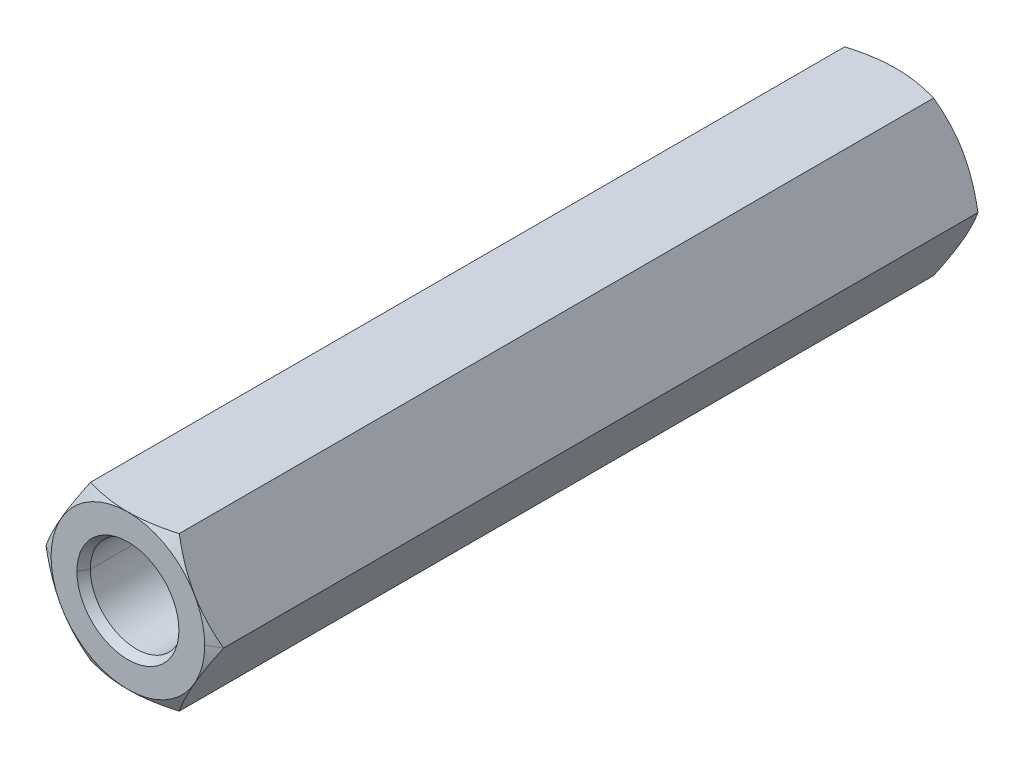
ISO-10303-21;
HEADER;
FILE_DESCRIPTION(('STEP AP214'),'2;1');
FILE_NAME('part.step','',(''),(''),'','','');
FILE_SCHEMA(('AUTOMOTIVE_DESIGN { 1 0 10303 214 1 1 1 1 }'));
ENDSEC;
DATA;
#1=APPLICATION_CONTEXT('core data for automotive mechanical design processes');
#2=APPLICATION_PROTOCOL_DEFINITION('international standard','automotive_design',2000,#1);
#3=PRODUCT_CONTEXT('',#1,'mechanical');
#4=PRODUCT('Part','Part','',(#3));
#5=PRODUCT_RELATED_PRODUCT_CATEGORY('part','',(#4));
#6=PRODUCT_DEFINITION_FORMATION('','',#4);
#7=PRODUCT_DEFINITION_CONTEXT('part definition',#1,'design');
#8=PRODUCT_DEFINITION('design','',#6,#7);
#9=PRODUCT_DEFINITION_SHAPE('','',#8);
#10=(LENGTH_UNIT() NAMED_UNIT(*) SI_UNIT(.MILLI.,.METRE.));
#11=(NAMED_UNIT(*) PLANE_ANGLE_UNIT() SI_UNIT($,.RADIAN.));
#12=(NAMED_UNIT(*) SI_UNIT($,.STERADIAN.) SOLID_ANGLE_UNIT());
#13=UNCERTAINTY_MEASURE_WITH_UNIT(LENGTH_MEASURE(1.E-05),#10,'distance_accuracy_value','');
#14=(GEOMETRIC_REPRESENTATION_CONTEXT(3) GLOBAL_UNCERTAINTY_ASSIGNED_CONTEXT((#13)) GLOBAL_UNIT_ASSIGNED_CONTEXT((#10,
#11,#12)) REPRESENTATION_CONTEXT('',''));
#15=CARTESIAN_POINT('',(0.,0.,0.));
#16=DIRECTION('',(0.,0.,1.));
#17=DIRECTION('',(1.,0.,0.));
#18=AXIS2_PLACEMENT_3D('',#15,#16,#17);
#19=CARTESIAN_POINT('',(220.318744279938,128.56204329235,90.4476083123826));
#20=DIRECTION('',(0.,0.,-1.));
#21=DIRECTION('',(1.,0.,0.));
#22=AXIS2_PLACEMENT_3D('',#19,#20,#21);
#23=CONICAL_SURFACE('',#22,1.7320508075705,1.047197551197);
#24=DIRECTION('',(0.86602540378464,0.,-0.499999999999652));
#25=VECTOR('',#24,1.);
#26=CARTESIAN_POINT('',(222.050795087508,128.56204329235,90.4476083123826));
#27=LINE('',#26,#25);
#28=CARTESIAN_POINT('',(220.318744279938,128.56204329235,91.4476083123826));
#29=VERTEX_POINT('',#28);
#30=CARTESIAN_POINT('',(221.818744279938,128.56204329235,90.5815829085986));
#31=VERTEX_POINT('',#30);
#32=EDGE_CURVE('E67',#29,#31,#27,.T.);
#33=ORIENTED_EDGE('',*,*,#32,.F.);
#34=DIRECTION('',(-0.86602540378464,0.,-0.499999999999652));
#35=VECTOR('',#34,1.);
#36=CARTESIAN_POINT('',(218.586693472367,128.56204329235,90.4476083123826));
#37=LINE('',#36,#35);
#38=CARTESIAN_POINT('',(218.818744279938,128.56204329235,90.5815829085986));
#39=VERTEX_POINT('',#38);
#40=EDGE_CURVE('E11',#29,#39,#37,.T.);
#41=ORIENTED_EDGE('',*,*,#40,.T.);
#42=CARTESIAN_POINT('',(220.318744279938,128.56204329235,90.5815829085986));
#43=DIRECTION('',(0.,0.,1.));
#44=DIRECTION('',(1.,0.,0.));
#45=AXIS2_PLACEMENT_3D('',#42,#43,#44);
#46=CIRCLE('',#45,1.5);
#47=EDGE_CURVE('E55',#31,#39,#46,.T.);
#48=ORIENTED_EDGE('',*,*,#47,.F.);
#49=EDGE_LOOP('',(#33,#41,#48));
#50=FACE_BOUND('',#49,.T.);
#51=ADVANCED_FACE('F44',(#50),#23,.F.);
#52=CARTESIAN_POINT('',(220.318744279938,128.56204329235,90.5815829085986));
#53=DIRECTION('',(0.,0.,-1.));
#54=DIRECTION('',(1.,0.,0.));
#55=AXIS2_PLACEMENT_3D('',#52,#53,#54);
#56=CYLINDRICAL_SURFACE('',#55,1.5);
#57=ORIENTED_EDGE('',*,*,#47,.T.);
#58=DIRECTION('',(0.,0.,-1.));
#59=VECTOR('',#58,1.);
#60=CARTESIAN_POINT('',(218.818744279938,128.56204329235,90.5815829085986));
#61=LINE('',#60,#59);
#62=CARTESIAN_POINT('',(218.818744279938,128.56204329235,80.8587110378087));
#63=VERTEX_POINT('',#62);
#64=EDGE_CURVE('E223',#39,#63,#61,.T.);
#65=ORIENTED_EDGE('',*,*,#64,.T.);
#66=CARTESIAN_POINT('',(220.318744279938,128.56204329235,80.8587110378087));
#67=DIRECTION('',(0.,0.,1.));
#68=DIRECTION('',(1.,0.,0.));
#69=AXIS2_PLACEMENT_3D('',#66,#67,#68);
#70=CIRCLE('',#69,1.5);
#71=CARTESIAN_POINT('',(221.818744279938,128.56204329235,80.8587110378087));
#72=VERTEX_POINT('',#71);
#73=EDGE_CURVE('E258',#72,#63,#70,.T.);
#74=ORIENTED_EDGE('',*,*,#73,.F.);
#75=DIRECTION('',(0.,0.,-1.));
#76=VECTOR('',#75,1.);
#77=CARTESIAN_POINT('',(221.818744279938,128.56204329235,90.5815829085986));
#78=LINE('',#77,#76);
#79=EDGE_CURVE('E226',#31,#72,#78,.T.);
#80=ORIENTED_EDGE('',*,*,#79,.F.);
#81=EDGE_LOOP('',(#57,#65,#74,#80));
#82=FACE_BOUND('',#81,.T.);
#83=ADVANCED_FACE('F381',(#82),#56,.F.);
#84=CARTESIAN_POINT('',(220.318744279938,128.56204329235,80.8587110378087));
#85=DIRECTION('',(0.,0.,-1.));
#86=DIRECTION('',(1.,0.,0.));
#87=AXIS2_PLACEMENT_3D('',#84,#85,#86);
#88=CONICAL_SURFACE('',#87,1.5,0.5235987756);
#89=ORIENTED_EDGE('',*,*,#73,.T.);
#90=DIRECTION('',(-0.500000000001473,0.,-0.866025403783588));
#91=VECTOR('',#90,1.);
#92=CARTESIAN_POINT('',(218.818744279938,128.56204329235,80.8587110378087));
#93=LINE('',#92,#91);
#94=CARTESIAN_POINT('',(218.658744279937,128.56204329235,80.5815829085986));
#95=VERTEX_POINT('',#94);
#96=EDGE_CURVE('E254',#63,#95,#93,.T.);
#97=ORIENTED_EDGE('',*,*,#96,.T.);
#98=CARTESIAN_POINT('',(220.318744279938,128.56204329235,80.5815829085986));
#99=DIRECTION('',(0.,0.,1.));
#100=DIRECTION('',(1.,0.,0.));
#101=AXIS2_PLACEMENT_3D('',#98,#99,#100);
#102=CIRCLE('',#101,1.66);
#103=CARTESIAN_POINT('',(221.978744279938,128.56204329235,80.5815829085986));
#104=VERTEX_POINT('',#103);
#105=EDGE_CURVE('E317',#104,#95,#102,.T.);
#106=ORIENTED_EDGE('',*,*,#105,.F.);
#107=DIRECTION('',(0.500000000001473,0.,-0.866025403783588));
#108=VECTOR('',#107,1.);
#109=CARTESIAN_POINT('',(221.818744279938,128.56204329235,80.8587110378087));
#110=LINE('',#109,#108);
#111=EDGE_CURVE('E253',#72,#104,#110,.T.);
#112=ORIENTED_EDGE('',*,*,#111,.F.);
#113=EDGE_LOOP('',(#89,#97,#106,#112));
#114=FACE_BOUND('',#113,.T.);
#115=ADVANCED_FACE('F372',(#114),#88,.F.);
#116=CARTESIAN_POINT('',(220.318744279938,128.56204329235,80.5815829085986));
#117=DIRECTION('',(0.,0.,1.));
#118=DIRECTION('',(1.,0.,0.));
#119=AXIS2_PLACEMENT_3D('',#116,#117,#118);
#120=CONICAL_SURFACE('',#119,2.5,1.047197551197);
#121=CARTESIAN_POINT('',(220.318744279938,128.56204329235,80.5815829085986));
#122=DIRECTION('',(0.,0.,1.));
#123=DIRECTION('',(1.,0.,0.));
#124=AXIS2_PLACEMENT_3D('',#121,#122,#123);
#125=CIRCLE('',#124,2.5);
#126=CARTESIAN_POINT('',(222.818744279938,128.56204329235,80.5815829085986));
#127=VERTEX_POINT('',#126);
#128=CARTESIAN_POINT('',(217.818744279938,128.56204329235,80.5815829085986));
#129=VERTEX_POINT('',#128);
#130=EDGE_CURVE('E259',#127,#129,#125,.T.);
#131=ORIENTED_EDGE('',*,*,#130,.T.);
#132=DIRECTION('',(-0.86602540378464,0.,0.499999999999652));
#133=VECTOR('',#132,1.);
#134=CARTESIAN_POINT('',(217.818744279938,128.56204329235,80.5815829085986));
#135=LINE('',#134,#133);
#136=CARTESIAN_POINT('',(217.428744279937,128.56204329235,80.8067495135827));
#137=VERTEX_POINT('',#136);
#138=EDGE_CURVE('E198',#129,#137,#135,.T.);
#139=ORIENTED_EDGE('',*,*,#138,.T.);
#140=CARTESIAN_POINT('',(218.873744279938,131.064856709287,80.8067495135827));
#141=CARTESIAN_POINT('',(218.151244279938,129.813450000819,80.3896139440931));
#142=CARTESIAN_POINT('',(217.428744279937,128.56204329235,80.8067495135827));
#143=(BOUNDED_CURVE() B_SPLINE_CURVE(2,(#140,#141,#142),.UNSPECIFIED.,.F.,
.F.) B_SPLINE_CURVE_WITH_KNOTS((3,3),(0.,1.),
.UNSPECIFIED.) CURVE() GEOMETRIC_REPRESENTATION_ITEM() RATIONAL_B_SPLINE_CURVE((1.,
1.15470053837935,1.)) REPRESENTATION_ITEM(''));
#144=CARTESIAN_POINT('',(218.873744279938,131.064856709287,80.8067495135827));
#145=VERTEX_POINT('',#144);
#146=EDGE_CURVE('E295',#145,#137,#143,.T.);
#147=ORIENTED_EDGE('',*,*,#146,.F.);
#148=CARTESIAN_POINT('',(221.763744279937,131.064856709287,80.8067495135827));
#149=CARTESIAN_POINT('',(220.318744279938,131.064856709288,80.3896139440931));
#150=CARTESIAN_POINT('',(218.873744279938,131.064856709287,80.8067495135827));
#151=(BOUNDED_CURVE() B_SPLINE_CURVE(2,(#148,#149,#150),.UNSPECIFIED.,.F.,
.F.) B_SPLINE_CURVE_WITH_KNOTS((3,3),(0.,1.),
.UNSPECIFIED.) CURVE() GEOMETRIC_REPRESENTATION_ITEM() RATIONAL_B_SPLINE_CURVE((1.,
1.15470053837926,1.)) REPRESENTATION_ITEM(''));
#152=CARTESIAN_POINT('',(221.763744279937,131.064856709287,80.8067495135827));
#153=VERTEX_POINT('',#152);
#154=EDGE_CURVE('E313',#153,#145,#151,.T.);
#155=ORIENTED_EDGE('',*,*,#154,.F.);
#156=CARTESIAN_POINT('',(223.208744279937,128.56204329235,80.8067495135827));
#157=CARTESIAN_POINT('',(222.486244279938,129.813450000819,80.389613944093));
#158=CARTESIAN_POINT('',(221.763744279937,131.064856709287,80.8067495135827));
#159=(BOUNDED_CURVE() B_SPLINE_CURVE(2,(#156,#157,#158),.UNSPECIFIED.,.F.,
.F.) B_SPLINE_CURVE_WITH_KNOTS((3,3),(0.,1.),
.UNSPECIFIED.) CURVE() GEOMETRIC_REPRESENTATION_ITEM() RATIONAL_B_SPLINE_CURVE((1.,
1.15470053837946,1.)) REPRESENTATION_ITEM(''));
#160=CARTESIAN_POINT('',(223.208744279937,128.56204329235,80.8067495135827));
#161=VERTEX_POINT('',#160);
#162=EDGE_CURVE('E238',#161,#153,#159,.T.);
#163=ORIENTED_EDGE('',*,*,#162,.F.);
#164=DIRECTION('',(0.86602540378464,0.,0.499999999999652));
#165=VECTOR('',#164,1.);
#166=CARTESIAN_POINT('',(222.818744279938,128.56204329235,80.5815829085986));
#167=LINE('',#166,#165);
#168=EDGE_CURVE('E314',#127,#161,#167,.T.);
#169=ORIENTED_EDGE('',*,*,#168,.F.);
#170=EDGE_LOOP('',(#131,#139,#147,#155,#163,#169));
#171=FACE_BOUND('',#170,.T.);
#172=ADVANCED_FACE('F433',(#171),#120,.T.);
#173=CARTESIAN_POINT('',(220.318744279938,128.56204329235,105.356416303615));
#174=DIRECTION('',(0.,0.,-1.));
#175=DIRECTION('',(1.,0.,0.));
#176=AXIS2_PLACEMENT_3D('',#173,#174,#175);
#177=CONICAL_SURFACE('',#176,2.89,1.047197551197);
#178=CARTESIAN_POINT('',(220.318744279938,128.56204329235,105.581582908599));
#179=DIRECTION('',(0.,0.,1.));
#180=DIRECTION('',(1.,0.,0.));
#181=AXIS2_PLACEMENT_3D('',#178,#179,#180);
#182=CIRCLE('',#181,2.5);
#183=CARTESIAN_POINT('',(217.818744279938,128.56204329235,105.581582908599));
#184=VERTEX_POINT('',#183);
#185=CARTESIAN_POINT('',(222.818744279938,128.56204329235,105.581582908599));
#186=VERTEX_POINT('',#185);
#187=EDGE_CURVE('E178',#184,#186,#182,.T.);
#188=ORIENTED_EDGE('',*,*,#187,.F.);
#189=DIRECTION('',(-0.86602540378464,0.,-0.499999999999652));
#190=VECTOR('',#189,1.);
#191=CARTESIAN_POINT('',(217.428744279937,128.56204329235,105.356416303615));
#192=LINE('',#191,#190);
#193=CARTESIAN_POINT('',(217.428744279937,128.562043292351,105.356416303615));
#194=VERTEX_POINT('',#193);
#195=EDGE_CURVE('E182',#184,#194,#192,.T.);
#196=ORIENTED_EDGE('',*,*,#195,.T.);
#197=CARTESIAN_POINT('',(218.873744279938,126.059229875413,105.356416303615));
#198=CARTESIAN_POINT('',(218.151244279937,127.310636583882,105.773551873104));
#199=CARTESIAN_POINT('',(217.428744279937,128.562043292351,105.356416303615));
#200=(BOUNDED_CURVE() B_SPLINE_CURVE(2,(#197,#198,#199),.UNSPECIFIED.,.F.,
.F.) B_SPLINE_CURVE_WITH_KNOTS((3,3),(0.,1.),
.UNSPECIFIED.) CURVE() GEOMETRIC_REPRESENTATION_ITEM() RATIONAL_B_SPLINE_CURVE((1.,
1.15470053837936,1.)) REPRESENTATION_ITEM(''));
#201=CARTESIAN_POINT('',(218.873744279938,126.059229875413,105.356416303615));
#202=VERTEX_POINT('',#201);
#203=EDGE_CURVE('E324',#202,#194,#200,.T.);
#204=ORIENTED_EDGE('',*,*,#203,.F.);
#205=CARTESIAN_POINT('',(221.763744279937,126.059229875413,105.356416303615));
#206=CARTESIAN_POINT('',(220.318744279937,126.059229875413,105.773551873104));
#207=CARTESIAN_POINT('',(218.873744279938,126.059229875413,105.356416303615));
#208=(BOUNDED_CURVE() B_SPLINE_CURVE(2,(#205,#206,#207),.UNSPECIFIED.,.F.,
.F.) B_SPLINE_CURVE_WITH_KNOTS((3,3),(0.,1.),
.UNSPECIFIED.) CURVE() GEOMETRIC_REPRESENTATION_ITEM() RATIONAL_B_SPLINE_CURVE((1.,
1.15470053837925,1.)) REPRESENTATION_ITEM(''));
#209=CARTESIAN_POINT('',(221.763744279937,126.059229875413,105.356416303615));
#210=VERTEX_POINT('',#209);
#211=EDGE_CURVE('E305',#210,#202,#208,.T.);
#212=ORIENTED_EDGE('',*,*,#211,.F.);
#213=CARTESIAN_POINT('',(223.208744279937,128.56204329235,105.356416303615));
#214=CARTESIAN_POINT('',(222.486244279938,127.310636583882,105.773551873104));
#215=CARTESIAN_POINT('',(221.763744279937,126.059229875413,105.356416303615));
#216=(BOUNDED_CURVE() B_SPLINE_CURVE(2,(#213,#214,#215),.UNSPECIFIED.,.F.,
.F.) B_SPLINE_CURVE_WITH_KNOTS((3,3),(0.,1.),
.UNSPECIFIED.) CURVE() GEOMETRIC_REPRESENTATION_ITEM() RATIONAL_B_SPLINE_CURVE((1.,
1.15470053837944,1.)) REPRESENTATION_ITEM(''));
#217=CARTESIAN_POINT('',(223.208744279937,128.56204329235,105.356416303615));
#218=VERTEX_POINT('',#217);
#219=EDGE_CURVE('E272',#218,#210,#216,.T.);
#220=ORIENTED_EDGE('',*,*,#219,.F.);
#221=DIRECTION('',(0.86602540378464,0.,-0.499999999999652));
#222=VECTOR('',#221,1.);
#223=CARTESIAN_POINT('',(223.208744279937,128.56204329235,105.356416303615));
#224=LINE('',#223,#222);
#225=EDGE_CURVE('E186',#186,#218,#224,.T.);
#226=ORIENTED_EDGE('',*,*,#225,.F.);
#227=EDGE_LOOP('',(#188,#196,#204,#212,#220,#226));
#228=FACE_BOUND('',#227,.T.);
#229=ADVANCED_FACE('F180',(#228),#177,.T.);
#230=CARTESIAN_POINT('',(220.318744279938,128.56204329235,105.581582908599));
#231=DIRECTION('',(0.,0.,1.));
#232=DIRECTION('',(1.,0.,0.));
#233=AXIS2_PLACEMENT_3D('',#230,#231,#232);
#234=CONICAL_SURFACE('',#233,1.65999999999899,0.523598775598);
#235=CARTESIAN_POINT('',(220.318744279938,128.56204329235,105.304454779389));
#236=DIRECTION('',(0.,0.,1.));
#237=DIRECTION('',(1.,0.,0.));
#238=AXIS2_PLACEMENT_3D('',#235,#236,#237);
#239=CIRCLE('',#238,1.5);
#240=CARTESIAN_POINT('',(218.818744279938,128.56204329235,105.304454779389));
#241=VERTEX_POINT('',#240);
#242=CARTESIAN_POINT('',(221.818744279938,128.56204329235,105.304454779389));
#243=VERTEX_POINT('',#242);
#244=EDGE_CURVE('E260',#241,#243,#239,.T.);
#245=ORIENTED_EDGE('',*,*,#244,.F.);
#246=DIRECTION('',(-0.499999999999741,0.,0.866025403784588));
#247=VECTOR('',#246,1.);
#248=CARTESIAN_POINT('',(218.658744279938,128.56204329235,105.581582908599));
#249=LINE('',#248,#247);
#250=CARTESIAN_POINT('',(218.658744279938,128.56204329235,105.581582908599));
#251=VERTEX_POINT('',#250);
#252=EDGE_CURVE('E199',#241,#251,#249,.T.);
#253=ORIENTED_EDGE('',*,*,#252,.T.);
#254=CARTESIAN_POINT('',(220.318744279938,128.56204329235,105.581582908599));
#255=DIRECTION('',(0.,0.,1.));
#256=DIRECTION('',(1.,0.,0.));
#257=AXIS2_PLACEMENT_3D('',#254,#255,#256);
#258=CIRCLE('',#257,1.65999999999899);
#259=CARTESIAN_POINT('',(221.978744279937,128.56204329235,105.581582908599));
#260=VERTEX_POINT('',#259);
#261=EDGE_CURVE('E230',#251,#260,#258,.T.);
#262=ORIENTED_EDGE('',*,*,#261,.T.);
#263=DIRECTION('',(0.499999999999741,0.,0.866025403784588));
#264=VECTOR('',#263,1.);
#265=CARTESIAN_POINT('',(221.978744279937,128.56204329235,105.581582908599));
#266=LINE('',#265,#264);
#267=EDGE_CURVE('E210',#243,#260,#266,.T.);
#268=ORIENTED_EDGE('',*,*,#267,.F.);
#269=EDGE_LOOP('',(#245,#253,#262,#268));
#270=FACE_BOUND('',#269,.T.);
#271=ADVANCED_FACE('F486',(#270),#234,.F.);
#272=CARTESIAN_POINT('',(220.318744279938,128.56204329235,105.304454779389));
#273=DIRECTION('',(0.,0.,-1.));
#274=DIRECTION('',(1.,0.,0.));
#275=AXIS2_PLACEMENT_3D('',#272,#273,#274);
#276=CYLINDRICAL_SURFACE('',#275,1.5);
#277=CARTESIAN_POINT('',(220.318744279938,128.56204329235,105.304454779389));
#278=DIRECTION('',(0.,0.,1.));
#279=DIRECTION('',(1.,0.,0.));
#280=AXIS2_PLACEMENT_3D('',#277,#278,#279);
#281=CIRCLE('',#280,1.5);
#282=EDGE_CURVE('E246',#243,#241,#281,.T.);
#283=ORIENTED_EDGE('',*,*,#282,.T.);
#284=DIRECTION('',(0.,0.,-1.));
#285=VECTOR('',#284,1.);
#286=CARTESIAN_POINT('',(218.818744279938,128.56204329235,105.304454779389));
#287=LINE('',#286,#285);
#288=CARTESIAN_POINT('',(218.818744279938,128.56204329235,95.5815829085986));
#289=VERTEX_POINT('',#288);
#290=EDGE_CURVE('E239',#241,#289,#287,.T.);
#291=ORIENTED_EDGE('',*,*,#290,.T.);
#292=CARTESIAN_POINT('',(220.318744279938,128.56204329235,95.5815829085986));
#293=DIRECTION('',(0.,0.,1.));
#294=DIRECTION('',(1.,0.,0.));
#295=AXIS2_PLACEMENT_3D('',#292,#293,#294);
#296=CIRCLE('',#295,1.5);
#297=CARTESIAN_POINT('',(221.818744279938,128.56204329235,95.5815829085986));
#298=VERTEX_POINT('',#297);
#299=EDGE_CURVE('E264',#298,#289,#296,.T.);
#300=ORIENTED_EDGE('',*,*,#299,.F.);
#301=DIRECTION('',(0.,0.,-1.));
#302=VECTOR('',#301,1.);
#303=CARTESIAN_POINT('',(221.818744279938,128.56204329235,105.304454779389));
#304=LINE('',#303,#302);
#305=EDGE_CURVE('E219',#243,#298,#304,.T.);
#306=ORIENTED_EDGE('',*,*,#305,.F.);
#307=EDGE_LOOP('',(#283,#291,#300,#306));
#308=FACE_BOUND('',#307,.T.);
#309=ADVANCED_FACE('F480',(#308),#276,.F.);
#310=CARTESIAN_POINT('',(220.318744279938,128.56204329235,95.5815829085986));
#311=DIRECTION('',(0.,0.,1.));
#312=DIRECTION('',(1.,0.,0.));
#313=AXIS2_PLACEMENT_3D('',#310,#311,#312);
#314=CONICAL_SURFACE('',#313,1.5,1.047197551197);
#315=DIRECTION('',(0.86602540378464,0.,0.499999999999652));
#316=VECTOR('',#315,1.);
#317=CARTESIAN_POINT('',(221.818744279938,128.56204329235,95.5815829085986));
#318=LINE('',#317,#316);
#319=CARTESIAN_POINT('',(220.318744279938,128.56204329235,94.7155575048136));
#320=VERTEX_POINT('',#319);
#321=EDGE_CURVE('E398',#320,#298,#318,.T.);
#322=ORIENTED_EDGE('',*,*,#321,.F.);
#323=DIRECTION('',(-0.86602540378464,0.,0.499999999999652));
#324=VECTOR('',#323,1.);
#325=CARTESIAN_POINT('',(218.818744279938,128.56204329235,95.5815829085986));
#326=LINE('',#325,#324);
#327=EDGE_CURVE('E247',#320,#289,#326,.T.);
#328=ORIENTED_EDGE('',*,*,#327,.T.);
#329=CARTESIAN_POINT('',(220.318744279938,128.56204329235,95.5815829085986));
#330=DIRECTION('',(0.,0.,1.));
#331=DIRECTION('',(1.,0.,0.));
#332=AXIS2_PLACEMENT_3D('',#329,#330,#331);
#333=CIRCLE('',#332,1.5);
#334=EDGE_CURVE('E339',#289,#298,#333,.T.);
#335=ORIENTED_EDGE('',*,*,#334,.T.);
#336=EDGE_LOOP('',(#322,#328,#335));
#337=FACE_BOUND('',#336,.T.);
#338=ADVANCED_FACE('F477',(#337),#314,.F.);
#339=CARTESIAN_POINT('',(220.318744279938,128.56204329235,95.5815829085986));
#340=DIRECTION('',(0.,0.,1.));
#341=DIRECTION('',(1.,0.,0.));
#342=AXIS2_PLACEMENT_3D('',#339,#340,#341);
#343=CONICAL_SURFACE('',#342,1.5,1.047197551197);
#344=ORIENTED_EDGE('',*,*,#327,.F.);
#345=ORIENTED_EDGE('',*,*,#321,.T.);
#346=ORIENTED_EDGE('',*,*,#299,.T.);
#347=EDGE_LOOP('',(#344,#345,#346));
#348=FACE_BOUND('',#347,.T.);
#349=ADVANCED_FACE('F46',(#348),#343,.F.);
#350=CARTESIAN_POINT('',(220.318744279938,128.56204329235,105.304454779389));
#351=DIRECTION('',(0.,0.,-1.));
#352=DIRECTION('',(1.,0.,0.));
#353=AXIS2_PLACEMENT_3D('',#350,#351,#352);
#354=CYLINDRICAL_SURFACE('',#353,1.5);
#355=ORIENTED_EDGE('',*,*,#290,.F.);
#356=ORIENTED_EDGE('',*,*,#244,.T.);
#357=ORIENTED_EDGE('',*,*,#305,.T.);
#358=ORIENTED_EDGE('',*,*,#334,.F.);
#359=EDGE_LOOP('',(#355,#356,#357,#358));
#360=FACE_BOUND('',#359,.T.);
#361=ADVANCED_FACE('F483',(#360),#354,.F.);
#362=CARTESIAN_POINT('',(220.318744279938,128.56204329235,105.581582908599));
#363=DIRECTION('',(0.,0.,1.));
#364=DIRECTION('',(1.,0.,0.));
#365=AXIS2_PLACEMENT_3D('',#362,#363,#364);
#366=CONICAL_SURFACE('',#365,1.65999999999899,0.523598775598);
#367=ORIENTED_EDGE('',*,*,#252,.F.);
#368=ORIENTED_EDGE('',*,*,#282,.F.);
#369=ORIENTED_EDGE('',*,*,#267,.T.);
#370=CARTESIAN_POINT('',(220.318744279938,128.56204329235,105.581582908599));
#371=DIRECTION('',(0.,0.,1.));
#372=DIRECTION('',(1.,0.,0.));
#373=AXIS2_PLACEMENT_3D('',#370,#371,#372);
#374=CIRCLE('',#373,1.65999999999899);
#375=EDGE_CURVE('E204',#260,#251,#374,.T.);
#376=ORIENTED_EDGE('',*,*,#375,.T.);
#377=EDGE_LOOP('',(#367,#368,#369,#376));
#378=FACE_BOUND('',#377,.T.);
#379=ADVANCED_FACE('F485',(#378),#366,.F.);
#380=CARTESIAN_POINT('',(220.318744279938,128.56204329235,105.581582908599));
#381=DIRECTION('',(0.,0.,1.));
#382=DIRECTION('',(1.,0.,0.));
#383=AXIS2_PLACEMENT_3D('',#380,#381,#382);
#384=PLANE('',#383);
#385=CARTESIAN_POINT('',(220.318744279938,128.56204329235,105.581582908599));
#386=DIRECTION('',(0.,0.,1.));
#387=DIRECTION('',(1.,0.,0.));
#388=AXIS2_PLACEMENT_3D('',#385,#386,#387);
#389=CIRCLE('',#388,2.5);
#390=EDGE_CURVE('E48',#186,#184,#389,.T.);
#391=ORIENTED_EDGE('',*,*,#390,.T.);
#392=ORIENTED_EDGE('',*,*,#187,.T.);
#393=EDGE_LOOP('',(#391,#392));
#394=FACE_BOUND('',#393,.T.);
#395=ORIENTED_EDGE('',*,*,#375,.F.);
#396=ORIENTED_EDGE('',*,*,#261,.F.);
#397=EDGE_LOOP('',(#395,#396));
#398=FACE_BOUND('',#397,.T.);
#399=ADVANCED_FACE('F201',(#394,#398),#384,.T.);
#400=CARTESIAN_POINT('',(220.318744279938,128.56204329235,105.356416303615));
#401=DIRECTION('',(0.,0.,-1.));
#402=DIRECTION('',(1.,0.,0.));
#403=AXIS2_PLACEMENT_3D('',#400,#401,#402);
#404=CONICAL_SURFACE('',#403,2.89,1.047197551197);
#405=ORIENTED_EDGE('',*,*,#195,.F.);
#406=ORIENTED_EDGE('',*,*,#390,.F.);
#407=ORIENTED_EDGE('',*,*,#225,.T.);
#408=CARTESIAN_POINT('',(221.763744279937,131.064856709287,105.356416303615));
#409=CARTESIAN_POINT('',(222.486244279938,129.813450000819,105.773551873104));
#410=CARTESIAN_POINT('',(223.208744279937,128.56204329235,105.356416303615));
#411=(BOUNDED_CURVE() B_SPLINE_CURVE(2,(#408,#409,#410),.UNSPECIFIED.,.F.,
.F.) B_SPLINE_CURVE_WITH_KNOTS((3,3),(0.,1.),
.UNSPECIFIED.) CURVE() GEOMETRIC_REPRESENTATION_ITEM() RATIONAL_B_SPLINE_CURVE((1.,
1.15470053837935,1.)) REPRESENTATION_ITEM(''));
#412=CARTESIAN_POINT('',(221.763744279937,131.064856709287,105.356416303615));
#413=VERTEX_POINT('',#412);
#414=EDGE_CURVE('E231',#413,#218,#411,.T.);
#415=ORIENTED_EDGE('',*,*,#414,.F.);
#416=CARTESIAN_POINT('',(218.873744279938,131.064856709287,105.356416303615));
#417=CARTESIAN_POINT('',(220.318744279937,131.064856709287,105.773551873104));
#418=CARTESIAN_POINT('',(221.763744279937,131.064856709287,105.356416303615));
#419=(BOUNDED_CURVE() B_SPLINE_CURVE(2,(#416,#417,#418),.UNSPECIFIED.,.F.,
.F.) B_SPLINE_CURVE_WITH_KNOTS((3,3),(0.,1.),
.UNSPECIFIED.) CURVE() GEOMETRIC_REPRESENTATION_ITEM() RATIONAL_B_SPLINE_CURVE((1.,
1.15470053837925,1.)) REPRESENTATION_ITEM(''));
#420=CARTESIAN_POINT('',(218.873744279938,131.064856709287,105.356416303615));
#421=VERTEX_POINT('',#420);
#422=EDGE_CURVE('E323',#421,#413,#419,.T.);
#423=ORIENTED_EDGE('',*,*,#422,.F.);
#424=CARTESIAN_POINT('',(217.428744279937,128.562043292351,105.356416303615));
#425=CARTESIAN_POINT('',(218.151244279937,129.813450000819,105.773551873104));
#426=CARTESIAN_POINT('',(218.873744279938,131.064856709287,105.356416303615));
#427=(BOUNDED_CURVE() B_SPLINE_CURVE(2,(#424,#425,#426),.UNSPECIFIED.,.F.,
.F.) B_SPLINE_CURVE_WITH_KNOTS((3,3),(0.,1.),
.UNSPECIFIED.) CURVE() GEOMETRIC_REPRESENTATION_ITEM() RATIONAL_B_SPLINE_CURVE((1.,
1.15470053837944,1.)) REPRESENTATION_ITEM(''));
#428=EDGE_CURVE('E195',#194,#421,#427,.T.);
#429=ORIENTED_EDGE('',*,*,#428,.F.);
#430=EDGE_LOOP('',(#405,#406,#407,#415,#423,#429));
#431=FACE_BOUND('',#430,.T.);
#432=ADVANCED_FACE('F193',(#431),#404,.T.);
#433=CARTESIAN_POINT('',(221.763744279937,126.059229875413,80.5815829085986));
#434=DIRECTION('',(-0.866025403784329,0.50000000000019,0.));
#435=DIRECTION('',(0.,0.,1.));
#436=AXIS2_PLACEMENT_3D('',#433,#434,#435);
#437=PLANE('',#436);
#438=DIRECTION('',(0.,0.,1.));
#439=VECTOR('',#438,1.);
#440=CARTESIAN_POINT('',(223.208744279937,128.56204329235,80.8067495135827));
#441=LINE('',#440,#439);
#442=EDGE_CURVE('E268',#161,#218,#441,.T.);
#443=ORIENTED_EDGE('',*,*,#442,.T.);
#444=ORIENTED_EDGE('',*,*,#219,.T.);
#445=DIRECTION('',(0.,0.,1.));
#446=VECTOR('',#445,1.);
#447=CARTESIAN_POINT('',(221.763744279937,126.059229875413,80.5815829085986));
#448=LINE('',#447,#446);
#449=CARTESIAN_POINT('',(221.763744279937,126.059229875413,80.8067495135827));
#450=VERTEX_POINT('',#449);
#451=EDGE_CURVE('E356',#450,#210,#448,.T.);
#452=ORIENTED_EDGE('',*,*,#451,.F.);
#453=CARTESIAN_POINT('',(221.763744279937,126.059229875413,80.8067495135827));
#454=CARTESIAN_POINT('',(222.486244279938,127.310636583882,80.389613944093));
#455=CARTESIAN_POINT('',(223.208744279937,128.56204329235,80.8067495135827));
#456=(BOUNDED_CURVE() B_SPLINE_CURVE(2,(#453,#454,#455),.UNSPECIFIED.,.F.,
.F.) B_SPLINE_CURVE_WITH_KNOTS((3,3),(0.,1.),
.UNSPECIFIED.) CURVE() GEOMETRIC_REPRESENTATION_ITEM() RATIONAL_B_SPLINE_CURVE((1.,
1.15470053837935,1.)) REPRESENTATION_ITEM(''));
#457=EDGE_CURVE('E281',#450,#161,#456,.T.);
#458=ORIENTED_EDGE('',*,*,#457,.T.);
#459=EDGE_LOOP('',(#443,#444,#452,#458));
#460=FACE_BOUND('',#459,.T.);
#461=ADVANCED_FACE('F496',(#460),#437,.F.);
#462=CARTESIAN_POINT('',(218.873744279938,126.059229875413,80.5815829085986));
#463=DIRECTION('',(0.,1.,0.));
#464=DIRECTION('',(1.,0.,0.));
#465=AXIS2_PLACEMENT_3D('',#462,#463,#464);
#466=PLANE('',#465);
#467=ORIENTED_EDGE('',*,*,#451,.T.);
#468=ORIENTED_EDGE('',*,*,#211,.T.);
#469=DIRECTION('',(0.,0.,1.));
#470=VECTOR('',#469,1.);
#471=CARTESIAN_POINT('',(218.873744279938,126.059229875413,80.5815829085986));
#472=LINE('',#471,#470);
#473=CARTESIAN_POINT('',(218.873744279938,126.059229875413,80.8067495135827));
#474=VERTEX_POINT('',#473);
#475=EDGE_CURVE('E306',#474,#202,#472,.T.);
#476=ORIENTED_EDGE('',*,*,#475,.F.);
#477=CARTESIAN_POINT('',(218.873744279938,126.059229875413,80.8067495135827));
#478=CARTESIAN_POINT('',(220.318744279938,126.059229875413,80.3896139440931));
#479=CARTESIAN_POINT('',(221.763744279937,126.059229875413,80.8067495135827));
#480=(BOUNDED_CURVE() B_SPLINE_CURVE(2,(#477,#478,#479),.UNSPECIFIED.,.F.,
.F.) B_SPLINE_CURVE_WITH_KNOTS((3,3),(0.,1.),
.UNSPECIFIED.) CURVE() GEOMETRIC_REPRESENTATION_ITEM() RATIONAL_B_SPLINE_CURVE((1.,
1.15470053837926,1.)) REPRESENTATION_ITEM(''));
#481=EDGE_CURVE('E296',#474,#450,#480,.T.);
#482=ORIENTED_EDGE('',*,*,#481,.T.);
#483=EDGE_LOOP('',(#467,#468,#476,#482));
#484=FACE_BOUND('',#483,.T.);
#485=ADVANCED_FACE('F537',(#484),#466,.F.);
#486=CARTESIAN_POINT('',(217.428744279937,128.56204329235,80.5815829085986));
#487=DIRECTION('',(0.866025403784329,0.50000000000019,0.));
#488=DIRECTION('',(0.,0.,-1.));
#489=AXIS2_PLACEMENT_3D('',#486,#487,#488);
#490=PLANE('',#489);
#491=ORIENTED_EDGE('',*,*,#475,.T.);
#492=ORIENTED_EDGE('',*,*,#203,.T.);
#493=DIRECTION('',(0.,0.,1.));
#494=VECTOR('',#493,1.);
#495=CARTESIAN_POINT('',(217.428744279937,128.56204329235,80.5815829085986));
#496=LINE('',#495,#494);
#497=EDGE_CURVE('E294',#137,#194,#496,.T.);
#498=ORIENTED_EDGE('',*,*,#497,.F.);
#499=CARTESIAN_POINT('',(217.428744279937,128.56204329235,80.8067495135827));
#500=CARTESIAN_POINT('',(218.151244279937,127.310636583882,80.3896139440929));
#501=CARTESIAN_POINT('',(218.873744279938,126.059229875413,80.8067495135827));
#502=(BOUNDED_CURVE() B_SPLINE_CURVE(2,(#499,#500,#501),.UNSPECIFIED.,.F.,
.F.) B_SPLINE_CURVE_WITH_KNOTS((3,3),(0.,1.),
.UNSPECIFIED.) CURVE() GEOMETRIC_REPRESENTATION_ITEM() RATIONAL_B_SPLINE_CURVE((1.,
1.15470053837945,1.)) REPRESENTATION_ITEM(''));
#503=EDGE_CURVE('E332',#137,#474,#502,.T.);
#504=ORIENTED_EDGE('',*,*,#503,.T.);
#505=EDGE_LOOP('',(#491,#492,#498,#504));
#506=FACE_BOUND('',#505,.T.);
#507=ADVANCED_FACE('F445',(#506),#490,.F.);
#508=CARTESIAN_POINT('',(218.873744279938,131.064856709287,80.5815829085986));
#509=DIRECTION('',(0.866025403784329,-0.50000000000019,0.));
#510=DIRECTION('',(0.,0.,-1.));
#511=AXIS2_PLACEMENT_3D('',#508,#509,#510);
#512=PLANE('',#511);
#513=ORIENTED_EDGE('',*,*,#497,.T.);
#514=ORIENTED_EDGE('',*,*,#428,.T.);
#515=DIRECTION('',(0.,0.,1.));
#516=VECTOR('',#515,1.);
#517=CARTESIAN_POINT('',(218.873744279938,131.064856709287,80.5815829085986));
#518=LINE('',#517,#516);
#519=EDGE_CURVE('E401',#145,#421,#518,.T.);
#520=ORIENTED_EDGE('',*,*,#519,.F.);
#521=ORIENTED_EDGE('',*,*,#146,.T.);
#522=EDGE_LOOP('',(#513,#514,#520,#521));
#523=FACE_BOUND('',#522,.T.);
#524=ADVANCED_FACE('F523',(#523),#512,.F.);
#525=CARTESIAN_POINT('',(221.763744279937,131.064856709287,80.5815829085986));
#526=DIRECTION('',(0.,-1.,0.));
#527=DIRECTION('',(-1.,0.,0.));
#528=AXIS2_PLACEMENT_3D('',#525,#526,#527);
#529=PLANE('',#528);
#530=ORIENTED_EDGE('',*,*,#519,.T.);
#531=ORIENTED_EDGE('',*,*,#422,.T.);
#532=DIRECTION('',(0.,0.,1.));
#533=VECTOR('',#532,1.);
#534=CARTESIAN_POINT('',(221.763744279937,131.064856709287,80.5815829085986));
#535=LINE('',#534,#533);
#536=EDGE_CURVE('E237',#153,#413,#535,.T.);
#537=ORIENTED_EDGE('',*,*,#536,.F.);
#538=ORIENTED_EDGE('',*,*,#154,.T.);
#539=EDGE_LOOP('',(#530,#531,#537,#538));
#540=FACE_BOUND('',#539,.T.);
#541=ADVANCED_FACE('F520',(#540),#529,.F.);
#542=CARTESIAN_POINT('',(223.208744279937,128.56204329235,80.5815829085986));
#543=DIRECTION('',(-0.866025403784329,-0.50000000000019,0.));
#544=DIRECTION('',(-0.50000000000019,0.866025403784329,0.));
#545=AXIS2_PLACEMENT_3D('',#542,#543,#544);
#546=PLANE('',#545);
#547=ORIENTED_EDGE('',*,*,#536,.T.);
#548=ORIENTED_EDGE('',*,*,#414,.T.);
#549=ORIENTED_EDGE('',*,*,#442,.F.);
#550=ORIENTED_EDGE('',*,*,#162,.T.);
#551=EDGE_LOOP('',(#547,#548,#549,#550));
#552=FACE_BOUND('',#551,.T.);
#553=ADVANCED_FACE('F522',(#552),#546,.F.);
#554=CARTESIAN_POINT('',(220.318744279938,128.56204329235,80.5815829085986));
#555=DIRECTION('',(0.,0.,1.));
#556=DIRECTION('',(1.,0.,0.));
#557=AXIS2_PLACEMENT_3D('',#554,#555,#556);
#558=CONICAL_SURFACE('',#557,2.5,1.047197551197);
#559=ORIENTED_EDGE('',*,*,#138,.F.);
#560=CARTESIAN_POINT('',(220.318744279938,128.56204329235,80.5815829085986));
#561=DIRECTION('',(0.,0.,1.));
#562=DIRECTION('',(1.,0.,0.));
#563=AXIS2_PLACEMENT_3D('',#560,#561,#562);
#564=CIRCLE('',#563,2.5);
#565=EDGE_CURVE('E316',#129,#127,#564,.T.);
#566=ORIENTED_EDGE('',*,*,#565,.T.);
#567=ORIENTED_EDGE('',*,*,#168,.T.);
#568=ORIENTED_EDGE('',*,*,#457,.F.);
#569=ORIENTED_EDGE('',*,*,#481,.F.);
#570=ORIENTED_EDGE('',*,*,#503,.F.);
#571=EDGE_LOOP('',(#559,#566,#567,#568,#569,#570));
#572=FACE_BOUND('',#571,.T.);
#573=ADVANCED_FACE('F440',(#572),#558,.T.);
#574=CARTESIAN_POINT('',(220.318744279938,128.56204329235,80.5815829085986));
#575=DIRECTION('',(0.,0.,1.));
#576=DIRECTION('',(1.,0.,0.));
#577=AXIS2_PLACEMENT_3D('',#574,#575,#576);
#578=PLANE('',#577);
#579=ORIENTED_EDGE('',*,*,#130,.F.);
#580=ORIENTED_EDGE('',*,*,#565,.F.);
#581=EDGE_LOOP('',(#579,#580));
#582=FACE_BOUND('',#581,.T.);
#583=ORIENTED_EDGE('',*,*,#105,.T.);
#584=CARTESIAN_POINT('',(220.318744279938,128.56204329235,80.5815829085986));
#585=DIRECTION('',(0.,0.,1.));
#586=DIRECTION('',(1.,0.,0.));
#587=AXIS2_PLACEMENT_3D('',#584,#585,#586);
#588=CIRCLE('',#587,1.66);
#589=EDGE_CURVE('E252',#95,#104,#588,.T.);
#590=ORIENTED_EDGE('',*,*,#589,.T.);
#591=EDGE_LOOP('',(#583,#590));
#592=FACE_BOUND('',#591,.T.);
#593=ADVANCED_FACE('F368',(#582,#592),#578,.F.);
#594=CARTESIAN_POINT('',(220.318744279938,128.56204329235,80.8587110378087));
#595=DIRECTION('',(0.,0.,-1.));
#596=DIRECTION('',(1.,0.,0.));
#597=AXIS2_PLACEMENT_3D('',#594,#595,#596);
#598=CONICAL_SURFACE('',#597,1.5,0.5235987756);
#599=ORIENTED_EDGE('',*,*,#96,.F.);
#600=CARTESIAN_POINT('',(220.318744279938,128.56204329235,80.8587110378087));
#601=DIRECTION('',(0.,0.,1.));
#602=DIRECTION('',(1.,0.,0.));
#603=AXIS2_PLACEMENT_3D('',#600,#601,#602);
#604=CIRCLE('',#603,1.5);
#605=EDGE_CURVE('E248',#63,#72,#604,.T.);
#606=ORIENTED_EDGE('',*,*,#605,.T.);
#607=ORIENTED_EDGE('',*,*,#111,.T.);
#608=ORIENTED_EDGE('',*,*,#589,.F.);
#609=EDGE_LOOP('',(#599,#606,#607,#608));
#610=FACE_BOUND('',#609,.T.);
#611=ADVANCED_FACE('F376',(#610),#598,.F.);
#612=CARTESIAN_POINT('',(220.318744279938,128.56204329235,90.5815829085986));
#613=DIRECTION('',(0.,0.,-1.));
#614=DIRECTION('',(1.,0.,0.));
#615=AXIS2_PLACEMENT_3D('',#612,#613,#614);
#616=CYLINDRICAL_SURFACE('',#615,1.5);
#617=ORIENTED_EDGE('',*,*,#64,.F.);
#618=CARTESIAN_POINT('',(220.318744279938,128.56204329235,90.5815829085986));
#619=DIRECTION('',(0.,0.,1.));
#620=DIRECTION('',(1.,0.,0.));
#621=AXIS2_PLACEMENT_3D('',#618,#619,#620);
#622=CIRCLE('',#621,1.5);
#623=EDGE_CURVE('E364',#39,#31,#622,.T.);
#624=ORIENTED_EDGE('',*,*,#623,.T.);
#625=ORIENTED_EDGE('',*,*,#79,.T.);
#626=ORIENTED_EDGE('',*,*,#605,.F.);
#627=EDGE_LOOP('',(#617,#624,#625,#626));
#628=FACE_BOUND('',#627,.T.);
#629=ADVANCED_FACE('F384',(#628),#616,.F.);
#630=CARTESIAN_POINT('',(220.318744279938,128.56204329235,90.4476083123826));
#631=DIRECTION('',(0.,0.,-1.));
#632=DIRECTION('',(1.,0.,0.));
#633=AXIS2_PLACEMENT_3D('',#630,#631,#632);
#634=CONICAL_SURFACE('',#633,1.7320508075705,1.047197551197);
#635=ORIENTED_EDGE('',*,*,#40,.F.);
#636=ORIENTED_EDGE('',*,*,#32,.T.);
#637=ORIENTED_EDGE('',*,*,#623,.F.);
#638=EDGE_LOOP('',(#635,#636,#637));
#639=FACE_BOUND('',#638,.T.);
#640=ADVANCED_FACE('F658',(#639),#634,.F.);
#641=CLOSED_SHELL('',(#51,#83,#115,#172,#229,#271,#309,#338,#349,#361,#379,#399,#432,#461,#485,
#507,#524,#541,#553,#573,#593,#611,#629,#640));
#642=MANIFOLD_SOLID_BREP('B2',#641);
#643=ADVANCED_BREP_SHAPE_REPRESENTATION('',(#18,#642),#14);
#644=SHAPE_DEFINITION_REPRESENTATION(#9,#643);
ENDSEC;
END-ISO-10303-21;
